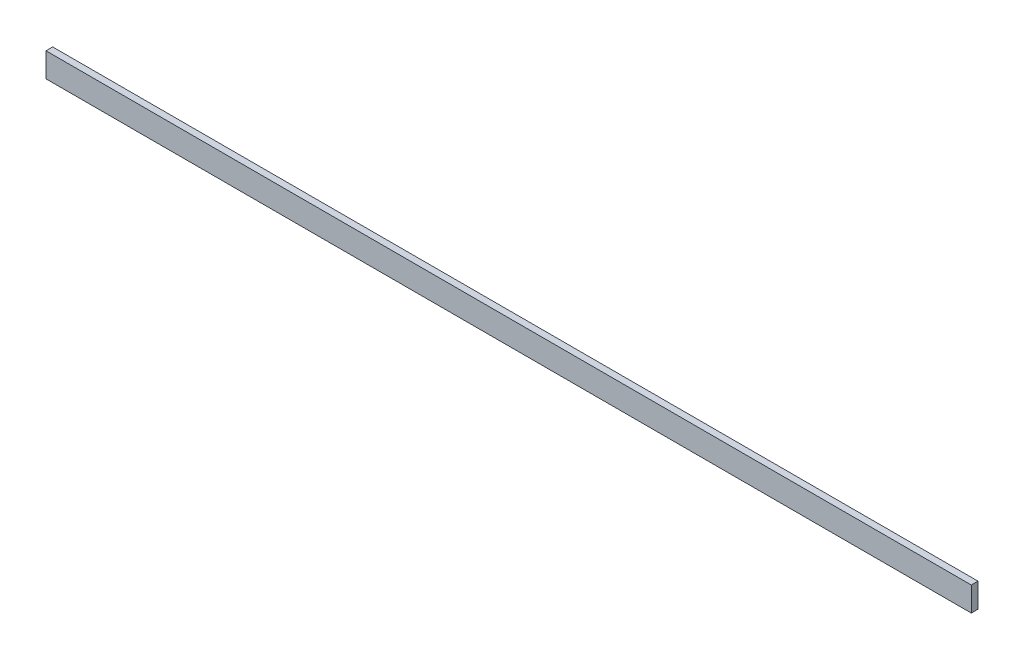
ISO-10303-21;
HEADER;
FILE_DESCRIPTION(('STEP AP214'),'2;1');
FILE_NAME('part.step','',(''),(''),'','','');
FILE_SCHEMA(('AUTOMOTIVE_DESIGN { 1 0 10303 214 1 1 1 1 }'));
ENDSEC;
DATA;
#1=APPLICATION_CONTEXT('core data for automotive mechanical design processes');
#2=APPLICATION_PROTOCOL_DEFINITION('international standard','automotive_design',2000,#1);
#3=PRODUCT_CONTEXT('',#1,'mechanical');
#4=PRODUCT('Part','Part','',(#3));
#5=PRODUCT_RELATED_PRODUCT_CATEGORY('part','',(#4));
#6=PRODUCT_DEFINITION_FORMATION('','',#4);
#7=PRODUCT_DEFINITION_CONTEXT('part definition',#1,'design');
#8=PRODUCT_DEFINITION('design','',#6,#7);
#9=PRODUCT_DEFINITION_SHAPE('','',#8);
#10=(LENGTH_UNIT() NAMED_UNIT(*) SI_UNIT(.MILLI.,.METRE.));
#11=(NAMED_UNIT(*) PLANE_ANGLE_UNIT() SI_UNIT($,.RADIAN.));
#12=(NAMED_UNIT(*) SI_UNIT($,.STERADIAN.) SOLID_ANGLE_UNIT());
#13=UNCERTAINTY_MEASURE_WITH_UNIT(LENGTH_MEASURE(1.E-05),#10,'distance_accuracy_value','');
#14=(GEOMETRIC_REPRESENTATION_CONTEXT(3) GLOBAL_UNCERTAINTY_ASSIGNED_CONTEXT((#13)) GLOBAL_UNIT_ASSIGNED_CONTEXT((#10,
#11,#12)) REPRESENTATION_CONTEXT('',''));
#15=CARTESIAN_POINT('',(0.,0.,0.));
#16=DIRECTION('',(0.,0.,1.));
#17=DIRECTION('',(1.,0.,0.));
#18=AXIS2_PLACEMENT_3D('',#15,#16,#17);
#19=CARTESIAN_POINT('',(0.,0.,22.));
#20=DIRECTION('',(1.,0.,0.));
#21=DIRECTION('',(0.,0.,-1.));
#22=AXIS2_PLACEMENT_3D('',#19,#20,#21);
#23=PLANE('',#22);
#24=DIRECTION('',(0.,-1.,0.));
#25=VECTOR('',#24,1.);
#26=CARTESIAN_POINT('',(0.,0.,0.));
#27=LINE('',#26,#25);
#28=CARTESIAN_POINT('',(0.,80.,0.));
#29=VERTEX_POINT('',#28);
#30=CARTESIAN_POINT('',(0.,0.,0.));
#31=VERTEX_POINT('',#30);
#32=EDGE_CURVE('E95',#29,#31,#27,.T.);
#33=ORIENTED_EDGE('',*,*,#32,.T.);
#34=DIRECTION('',(0.,0.,-1.));
#35=VECTOR('',#34,1.);
#36=CARTESIAN_POINT('',(0.,0.,22.));
#37=LINE('',#36,#35);
#38=CARTESIAN_POINT('',(0.,0.,22.));
#39=VERTEX_POINT('',#38);
#40=EDGE_CURVE('E11',#39,#31,#37,.T.);
#41=ORIENTED_EDGE('',*,*,#40,.F.);
#42=DIRECTION('',(0.,-1.,0.));
#43=VECTOR('',#42,1.);
#44=CARTESIAN_POINT('',(0.,0.,22.));
#45=LINE('',#44,#43);
#46=CARTESIAN_POINT('',(0.,80.,22.));
#47=VERTEX_POINT('',#46);
#48=EDGE_CURVE('E83',#47,#39,#45,.T.);
#49=ORIENTED_EDGE('',*,*,#48,.F.);
#50=DIRECTION('',(0.,0.,-1.));
#51=VECTOR('',#50,1.);
#52=CARTESIAN_POINT('',(0.,80.,22.));
#53=LINE('',#52,#51);
#54=EDGE_CURVE('E91',#47,#29,#53,.T.);
#55=ORIENTED_EDGE('',*,*,#54,.T.);
#56=EDGE_LOOP('',(#33,#41,#49,#55));
#57=FACE_BOUND('',#56,.T.);
#58=ADVANCED_FACE('F32',(#57),#23,.F.);
#59=CARTESIAN_POINT('',(0.,0.,22.));
#60=DIRECTION('',(0.,1.,0.));
#61=DIRECTION('',(0.,0.,1.));
#62=AXIS2_PLACEMENT_3D('',#59,#60,#61);
#63=PLANE('',#62);
#64=DIRECTION('',(1.,0.,0.));
#65=VECTOR('',#64,1.);
#66=CARTESIAN_POINT('',(0.,0.,0.));
#67=LINE('',#66,#65);
#68=CARTESIAN_POINT('',(3044.,0.,0.));
#69=VERTEX_POINT('',#68);
#70=EDGE_CURVE('E87',#31,#69,#67,.T.);
#71=ORIENTED_EDGE('',*,*,#70,.T.);
#72=DIRECTION('',(0.,0.,-1.));
#73=VECTOR('',#72,1.);
#74=CARTESIAN_POINT('',(3044.,0.,22.));
#75=LINE('',#74,#73);
#76=CARTESIAN_POINT('',(3044.,0.,22.));
#77=VERTEX_POINT('',#76);
#78=EDGE_CURVE('E40',#77,#69,#75,.T.);
#79=ORIENTED_EDGE('',*,*,#78,.F.);
#80=DIRECTION('',(1.,0.,0.));
#81=VECTOR('',#80,1.);
#82=CARTESIAN_POINT('',(0.,0.,22.));
#83=LINE('',#82,#81);
#84=EDGE_CURVE('E78',#39,#77,#83,.T.);
#85=ORIENTED_EDGE('',*,*,#84,.F.);
#86=ORIENTED_EDGE('',*,*,#40,.T.);
#87=EDGE_LOOP('',(#71,#79,#85,#86));
#88=FACE_BOUND('',#87,.T.);
#89=ADVANCED_FACE('F86',(#88),#63,.F.);
#90=CARTESIAN_POINT('',(3044.,0.,22.));
#91=DIRECTION('',(-1.,0.,0.));
#92=DIRECTION('',(0.,0.,1.));
#93=AXIS2_PLACEMENT_3D('',#90,#91,#92);
#94=PLANE('',#93);
#95=DIRECTION('',(0.,1.,0.));
#96=VECTOR('',#95,1.);
#97=CARTESIAN_POINT('',(3044.,0.,0.));
#98=LINE('',#97,#96);
#99=CARTESIAN_POINT('',(3044.,80.,0.));
#100=VERTEX_POINT('',#99);
#101=EDGE_CURVE('E65',#69,#100,#98,.T.);
#102=ORIENTED_EDGE('',*,*,#101,.T.);
#103=DIRECTION('',(0.,0.,-1.));
#104=VECTOR('',#103,1.);
#105=CARTESIAN_POINT('',(3044.,80.,22.));
#106=LINE('',#105,#104);
#107=CARTESIAN_POINT('',(3044.,80.,22.));
#108=VERTEX_POINT('',#107);
#109=EDGE_CURVE('E88',#108,#100,#106,.T.);
#110=ORIENTED_EDGE('',*,*,#109,.F.);
#111=DIRECTION('',(0.,1.,0.));
#112=VECTOR('',#111,1.);
#113=CARTESIAN_POINT('',(3044.,0.,22.));
#114=LINE('',#113,#112);
#115=EDGE_CURVE('E81',#77,#108,#114,.T.);
#116=ORIENTED_EDGE('',*,*,#115,.F.);
#117=ORIENTED_EDGE('',*,*,#78,.T.);
#118=EDGE_LOOP('',(#102,#110,#116,#117));
#119=FACE_BOUND('',#118,.T.);
#120=ADVANCED_FACE('F89',(#119),#94,.F.);
#121=CARTESIAN_POINT('',(0.,80.,22.));
#122=DIRECTION('',(0.,-1.,0.));
#123=DIRECTION('',(0.,0.,-1.));
#124=AXIS2_PLACEMENT_3D('',#121,#122,#123);
#125=PLANE('',#124);
#126=DIRECTION('',(-1.,0.,0.));
#127=VECTOR('',#126,1.);
#128=CARTESIAN_POINT('',(0.,80.,0.));
#129=LINE('',#128,#127);
#130=EDGE_CURVE('E71',#100,#29,#129,.T.);
#131=ORIENTED_EDGE('',*,*,#130,.T.);
#132=ORIENTED_EDGE('',*,*,#54,.F.);
#133=DIRECTION('',(-1.,0.,0.));
#134=VECTOR('',#133,1.);
#135=CARTESIAN_POINT('',(0.,80.,22.));
#136=LINE('',#135,#134);
#137=EDGE_CURVE('E48',#108,#47,#136,.T.);
#138=ORIENTED_EDGE('',*,*,#137,.F.);
#139=ORIENTED_EDGE('',*,*,#109,.T.);
#140=EDGE_LOOP('',(#131,#132,#138,#139));
#141=FACE_BOUND('',#140,.T.);
#142=ADVANCED_FACE('F102',(#141),#125,.F.);
#143=CARTESIAN_POINT('',(0.,80.,22.));
#144=DIRECTION('',(0.,0.,-1.));
#145=DIRECTION('',(-1.,0.,0.));
#146=AXIS2_PLACEMENT_3D('',#143,#144,#145);
#147=PLANE('',#146);
#148=ORIENTED_EDGE('',*,*,#48,.T.);
#149=ORIENTED_EDGE('',*,*,#84,.T.);
#150=ORIENTED_EDGE('',*,*,#115,.T.);
#151=ORIENTED_EDGE('',*,*,#137,.T.);
#152=EDGE_LOOP('',(#148,#149,#150,#151));
#153=FACE_BOUND('',#152,.T.);
#154=ADVANCED_FACE('F79',(#153),#147,.F.);
#155=CARTESIAN_POINT('',(0.,80.,0.));
#156=DIRECTION('',(0.,0.,-1.));
#157=DIRECTION('',(-1.,0.,0.));
#158=AXIS2_PLACEMENT_3D('',#155,#156,#157);
#159=PLANE('',#158);
#160=ORIENTED_EDGE('',*,*,#32,.F.);
#161=ORIENTED_EDGE('',*,*,#130,.F.);
#162=ORIENTED_EDGE('',*,*,#101,.F.);
#163=ORIENTED_EDGE('',*,*,#70,.F.);
#164=EDGE_LOOP('',(#160,#161,#162,#163));
#165=FACE_BOUND('',#164,.T.);
#166=ADVANCED_FACE('F105',(#165),#159,.T.);
#167=CLOSED_SHELL('',(#58,#89,#120,#142,#154,#166));
#168=MANIFOLD_SOLID_BREP('B2',#167);
#169=ADVANCED_BREP_SHAPE_REPRESENTATION('',(#18,#168),#14);
#170=SHAPE_DEFINITION_REPRESENTATION(#9,#169);
ENDSEC;
END-ISO-10303-21;
